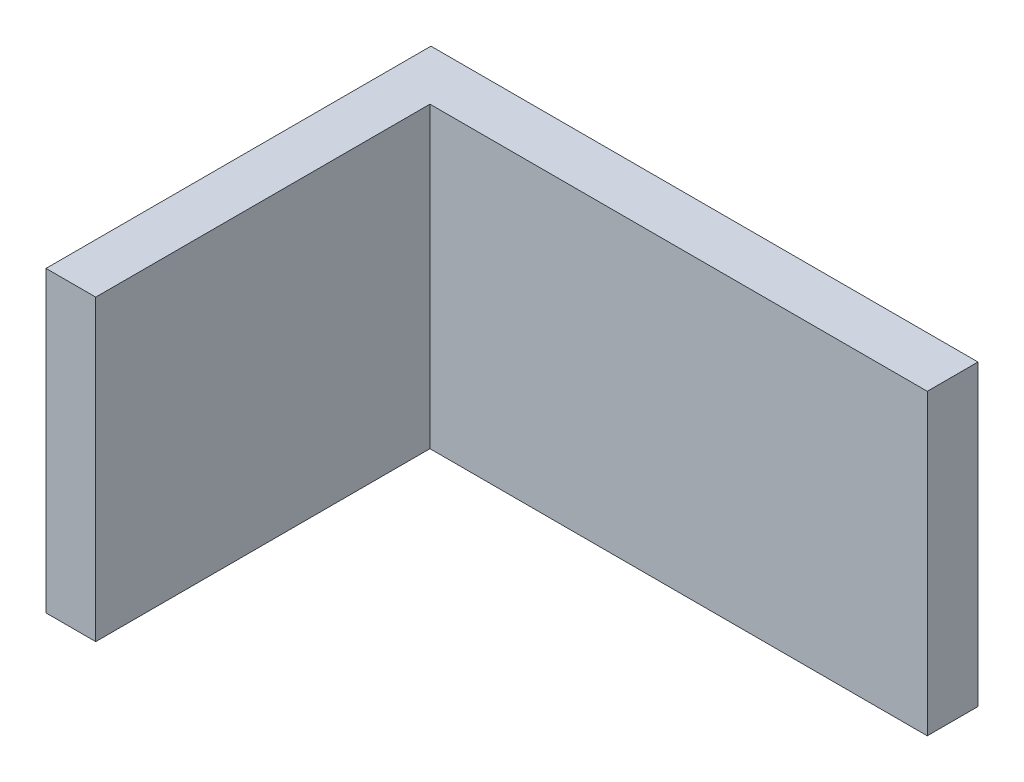
ISO-10303-21;
HEADER;
FILE_DESCRIPTION(('STEP AP214'),'2;1');
FILE_NAME('part.step','',(''),(''),'','','');
FILE_SCHEMA(('AUTOMOTIVE_DESIGN { 1 0 10303 214 1 1 1 1 }'));
ENDSEC;
DATA;
#1=APPLICATION_CONTEXT('core data for automotive mechanical design processes');
#2=APPLICATION_PROTOCOL_DEFINITION('international standard','automotive_design',2000,#1);
#3=PRODUCT_CONTEXT('',#1,'mechanical');
#4=PRODUCT('Part','Part','',(#3));
#5=PRODUCT_RELATED_PRODUCT_CATEGORY('part','',(#4));
#6=PRODUCT_DEFINITION_FORMATION('','',#4);
#7=PRODUCT_DEFINITION_CONTEXT('part definition',#1,'design');
#8=PRODUCT_DEFINITION('design','',#6,#7);
#9=PRODUCT_DEFINITION_SHAPE('','',#8);
#10=(LENGTH_UNIT() NAMED_UNIT(*) SI_UNIT(.MILLI.,.METRE.));
#11=(NAMED_UNIT(*) PLANE_ANGLE_UNIT() SI_UNIT($,.RADIAN.));
#12=(NAMED_UNIT(*) SI_UNIT($,.STERADIAN.) SOLID_ANGLE_UNIT());
#13=UNCERTAINTY_MEASURE_WITH_UNIT(LENGTH_MEASURE(1.E-05),#10,'distance_accuracy_value','');
#14=(GEOMETRIC_REPRESENTATION_CONTEXT(3) GLOBAL_UNCERTAINTY_ASSIGNED_CONTEXT((#13)) GLOBAL_UNIT_ASSIGNED_CONTEXT((#10,
#11,#12)) REPRESENTATION_CONTEXT('',''));
#15=CARTESIAN_POINT('',(0.,0.,0.));
#16=DIRECTION('',(0.,0.,1.));
#17=DIRECTION('',(1.,0.,0.));
#18=AXIS2_PLACEMENT_3D('',#15,#16,#17);
#19=CARTESIAN_POINT('',(-4.55,-2.9,0.));
#20=DIRECTION('',(0.,-1.,0.));
#21=DIRECTION('',(0.,0.,1.));
#22=AXIS2_PLACEMENT_3D('',#19,#20,#21);
#23=PLANE('',#22);
#24=DIRECTION('',(-1.,0.,0.));
#25=VECTOR('',#24,1.);
#26=CARTESIAN_POINT('',(-4.,-2.9,0.));
#27=LINE('',#26,#25);
#28=CARTESIAN_POINT('',(-4.,-2.9,0.));
#29=VERTEX_POINT('',#28);
#30=CARTESIAN_POINT('',(-4.55,-2.9,0.));
#31=VERTEX_POINT('',#30);
#32=EDGE_CURVE('E11',#29,#31,#27,.T.);
#33=ORIENTED_EDGE('',*,*,#32,.F.);
#34=DIRECTION('',(0.,0.,-1.));
#35=VECTOR('',#34,1.);
#36=CARTESIAN_POINT('',(-4.,-2.9,0.051));
#37=LINE('',#36,#35);
#38=CARTESIAN_POINT('',(-4.,-2.9,0.051));
#39=VERTEX_POINT('',#38);
#40=EDGE_CURVE('E24',#39,#29,#37,.T.);
#41=ORIENTED_EDGE('',*,*,#40,.F.);
#42=DIRECTION('',(1.,0.,0.));
#43=VECTOR('',#42,1.);
#44=CARTESIAN_POINT('',(-4.5,-2.9,0.051));
#45=LINE('',#44,#43);
#46=CARTESIAN_POINT('',(-4.5,-2.9,0.051));
#47=VERTEX_POINT('',#46);
#48=EDGE_CURVE('E87',#47,#39,#45,.T.);
#49=ORIENTED_EDGE('',*,*,#48,.F.);
#50=DIRECTION('',(0.,0.,-1.));
#51=VECTOR('',#50,1.);
#52=CARTESIAN_POINT('',(-4.5,-2.9,0.387));
#53=LINE('',#52,#51);
#54=CARTESIAN_POINT('',(-4.5,-2.9,0.387));
#55=VERTEX_POINT('',#54);
#56=EDGE_CURVE('E114',#55,#47,#53,.T.);
#57=ORIENTED_EDGE('',*,*,#56,.F.);
#58=DIRECTION('',(1.,0.,0.));
#59=VECTOR('',#58,1.);
#60=CARTESIAN_POINT('',(-4.55,-2.9,0.387));
#61=LINE('',#60,#59);
#62=CARTESIAN_POINT('',(-4.55,-2.9,0.387));
#63=VERTEX_POINT('',#62);
#64=EDGE_CURVE('E111',#63,#55,#61,.T.);
#65=ORIENTED_EDGE('',*,*,#64,.F.);
#66=DIRECTION('',(0.,0.,1.));
#67=VECTOR('',#66,1.);
#68=CARTESIAN_POINT('',(-4.55,-2.9,0.));
#69=LINE('',#68,#67);
#70=EDGE_CURVE('E108',#31,#63,#69,.T.);
#71=ORIENTED_EDGE('',*,*,#70,.F.);
#72=EDGE_LOOP('',(#33,#41,#49,#57,#65,#71));
#73=FACE_BOUND('',#72,.T.);
#74=ADVANCED_FACE('F17',(#73),#23,.T.);
#75=CARTESIAN_POINT('',(-4.,-2.6,0.));
#76=DIRECTION('',(0.,1.,0.));
#77=DIRECTION('',(0.,0.,1.));
#78=AXIS2_PLACEMENT_3D('',#75,#76,#77);
#79=PLANE('',#78);
#80=DIRECTION('',(1.,0.,0.));
#81=VECTOR('',#80,1.);
#82=CARTESIAN_POINT('',(-4.55,-2.6,0.));
#83=LINE('',#82,#81);
#84=CARTESIAN_POINT('',(-4.55,-2.6,0.));
#85=VERTEX_POINT('',#84);
#86=CARTESIAN_POINT('',(-4.,-2.6,0.));
#87=VERTEX_POINT('',#86);
#88=EDGE_CURVE('E106',#85,#87,#83,.T.);
#89=ORIENTED_EDGE('',*,*,#88,.F.);
#90=DIRECTION('',(0.,0.,-1.));
#91=VECTOR('',#90,1.);
#92=CARTESIAN_POINT('',(-4.55,-2.6,0.387));
#93=LINE('',#92,#91);
#94=CARTESIAN_POINT('',(-4.55,-2.6,0.387));
#95=VERTEX_POINT('',#94);
#96=EDGE_CURVE('E103',#95,#85,#93,.T.);
#97=ORIENTED_EDGE('',*,*,#96,.F.);
#98=DIRECTION('',(-1.,0.,0.));
#99=VECTOR('',#98,1.);
#100=CARTESIAN_POINT('',(-4.5,-2.6,0.387));
#101=LINE('',#100,#99);
#102=CARTESIAN_POINT('',(-4.5,-2.6,0.387));
#103=VERTEX_POINT('',#102);
#104=EDGE_CURVE('E100',#103,#95,#101,.T.);
#105=ORIENTED_EDGE('',*,*,#104,.F.);
#106=DIRECTION('',(0.,0.,1.));
#107=VECTOR('',#106,1.);
#108=CARTESIAN_POINT('',(-4.5,-2.6,0.051));
#109=LINE('',#108,#107);
#110=CARTESIAN_POINT('',(-4.5,-2.6,0.051));
#111=VERTEX_POINT('',#110);
#112=EDGE_CURVE('E72',#111,#103,#109,.T.);
#113=ORIENTED_EDGE('',*,*,#112,.F.);
#114=DIRECTION('',(-1.,0.,0.));
#115=VECTOR('',#114,1.);
#116=CARTESIAN_POINT('',(-4.,-2.6,0.051));
#117=LINE('',#116,#115);
#118=CARTESIAN_POINT('',(-4.,-2.6,0.051));
#119=VERTEX_POINT('',#118);
#120=EDGE_CURVE('E66',#119,#111,#117,.T.);
#121=ORIENTED_EDGE('',*,*,#120,.F.);
#122=DIRECTION('',(0.,0.,1.));
#123=VECTOR('',#122,1.);
#124=CARTESIAN_POINT('',(-4.,-2.6,0.));
#125=LINE('',#124,#123);
#126=EDGE_CURVE('E69',#87,#119,#125,.T.);
#127=ORIENTED_EDGE('',*,*,#126,.F.);
#128=EDGE_LOOP('',(#89,#97,#105,#113,#121,#127));
#129=FACE_BOUND('',#128,.T.);
#130=ADVANCED_FACE('F68',(#129),#79,.T.);
#131=CARTESIAN_POINT('',(-4.55,-2.9,0.387));
#132=DIRECTION('',(0.,0.,1.));
#133=DIRECTION('',(0.,1.,0.));
#134=AXIS2_PLACEMENT_3D('',#131,#132,#133);
#135=PLANE('',#134);
#136=ORIENTED_EDGE('',*,*,#64,.T.);
#137=DIRECTION('',(0.,-1.,0.));
#138=VECTOR('',#137,1.);
#139=CARTESIAN_POINT('',(-4.5,-2.6,0.387));
#140=LINE('',#139,#138);
#141=EDGE_CURVE('E83',#103,#55,#140,.T.);
#142=ORIENTED_EDGE('',*,*,#141,.F.);
#143=ORIENTED_EDGE('',*,*,#104,.T.);
#144=DIRECTION('',(0.,1.,0.));
#145=VECTOR('',#144,1.);
#146=CARTESIAN_POINT('',(-4.55,-2.9,0.387));
#147=LINE('',#146,#145);
#148=EDGE_CURVE('E88',#63,#95,#147,.T.);
#149=ORIENTED_EDGE('',*,*,#148,.F.);
#150=EDGE_LOOP('',(#136,#142,#143,#149));
#151=FACE_BOUND('',#150,.T.);
#152=ADVANCED_FACE('F125',(#151),#135,.T.);
#153=CARTESIAN_POINT('',(-4.5,-2.9,0.051));
#154=DIRECTION('',(0.,0.,1.));
#155=DIRECTION('',(0.,1.,0.));
#156=AXIS2_PLACEMENT_3D('',#153,#154,#155);
#157=PLANE('',#156);
#158=ORIENTED_EDGE('',*,*,#48,.T.);
#159=DIRECTION('',(0.,-1.,0.));
#160=VECTOR('',#159,1.);
#161=CARTESIAN_POINT('',(-4.,-2.6,0.051));
#162=LINE('',#161,#160);
#163=EDGE_CURVE('E81',#119,#39,#162,.T.);
#164=ORIENTED_EDGE('',*,*,#163,.F.);
#165=ORIENTED_EDGE('',*,*,#120,.T.);
#166=DIRECTION('',(0.,1.,0.));
#167=VECTOR('',#166,1.);
#168=CARTESIAN_POINT('',(-4.5,-2.9,0.051));
#169=LINE('',#168,#167);
#170=EDGE_CURVE('E89',#47,#111,#169,.T.);
#171=ORIENTED_EDGE('',*,*,#170,.F.);
#172=EDGE_LOOP('',(#158,#164,#165,#171));
#173=FACE_BOUND('',#172,.T.);
#174=ADVANCED_FACE('F86',(#173),#157,.T.);
#175=CARTESIAN_POINT('',(-4.55,-2.6,0.));
#176=DIRECTION('',(-1.,0.,0.));
#177=DIRECTION('',(0.,0.,1.));
#178=AXIS2_PLACEMENT_3D('',#175,#176,#177);
#179=PLANE('',#178);
#180=DIRECTION('',(0.,1.,0.));
#181=VECTOR('',#180,1.);
#182=CARTESIAN_POINT('',(-4.55,-2.9,0.));
#183=LINE('',#182,#181);
#184=EDGE_CURVE('E93',#31,#85,#183,.T.);
#185=ORIENTED_EDGE('',*,*,#184,.F.);
#186=ORIENTED_EDGE('',*,*,#70,.T.);
#187=ORIENTED_EDGE('',*,*,#148,.T.);
#188=ORIENTED_EDGE('',*,*,#96,.T.);
#189=EDGE_LOOP('',(#185,#186,#187,#188));
#190=FACE_BOUND('',#189,.T.);
#191=ADVANCED_FACE('F121',(#190),#179,.T.);
#192=CARTESIAN_POINT('',(-4.,-2.9,0.));
#193=DIRECTION('',(1.,0.,0.));
#194=DIRECTION('',(0.,0.,1.));
#195=AXIS2_PLACEMENT_3D('',#192,#193,#194);
#196=PLANE('',#195);
#197=DIRECTION('',(0.,-1.,0.));
#198=VECTOR('',#197,1.);
#199=CARTESIAN_POINT('',(-4.,-2.6,0.));
#200=LINE('',#199,#198);
#201=EDGE_CURVE('E82',#87,#29,#200,.T.);
#202=ORIENTED_EDGE('',*,*,#201,.F.);
#203=ORIENTED_EDGE('',*,*,#126,.T.);
#204=ORIENTED_EDGE('',*,*,#163,.T.);
#205=ORIENTED_EDGE('',*,*,#40,.T.);
#206=EDGE_LOOP('',(#202,#203,#204,#205));
#207=FACE_BOUND('',#206,.T.);
#208=ADVANCED_FACE('F80',(#207),#196,.T.);
#209=CARTESIAN_POINT('',(-4.5,-2.9,0.051));
#210=DIRECTION('',(1.,0.,0.));
#211=DIRECTION('',(0.,0.,1.));
#212=AXIS2_PLACEMENT_3D('',#209,#210,#211);
#213=PLANE('',#212);
#214=ORIENTED_EDGE('',*,*,#170,.T.);
#215=ORIENTED_EDGE('',*,*,#112,.T.);
#216=ORIENTED_EDGE('',*,*,#141,.T.);
#217=ORIENTED_EDGE('',*,*,#56,.T.);
#218=EDGE_LOOP('',(#214,#215,#216,#217));
#219=FACE_BOUND('',#218,.T.);
#220=ADVANCED_FACE('F127',(#219),#213,.T.);
#221=CARTESIAN_POINT('',(-4.55,-2.6,0.));
#222=DIRECTION('',(0.,0.,-1.));
#223=DIRECTION('',(0.,1.,0.));
#224=AXIS2_PLACEMENT_3D('',#221,#222,#223);
#225=PLANE('',#224);
#226=ORIENTED_EDGE('',*,*,#88,.T.);
#227=ORIENTED_EDGE('',*,*,#201,.T.);
#228=ORIENTED_EDGE('',*,*,#32,.T.);
#229=ORIENTED_EDGE('',*,*,#184,.T.);
#230=EDGE_LOOP('',(#226,#227,#228,#229));
#231=FACE_BOUND('',#230,.T.);
#232=ADVANCED_FACE('F117',(#231),#225,.T.);
#233=CLOSED_SHELL('',(#74,#130,#152,#174,#191,#208,#220,#232));
#234=MANIFOLD_SOLID_BREP('B1',#233);
#235=ADVANCED_BREP_SHAPE_REPRESENTATION('',(#18,#234),#14);
#236=SHAPE_DEFINITION_REPRESENTATION(#9,#235);
ENDSEC;
END-ISO-10303-21;
